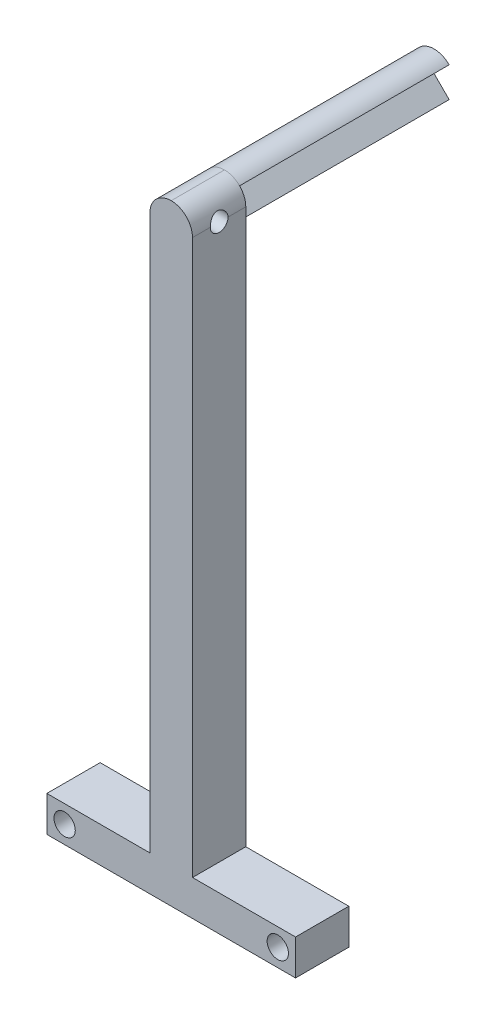
ISO-10303-21;
HEADER;
FILE_DESCRIPTION(('STEP AP214'),'2;1');
FILE_NAME('part.step','',(''),(''),'','','');
FILE_SCHEMA(('AUTOMOTIVE_DESIGN { 1 0 10303 214 1 1 1 1 }'));
ENDSEC;
DATA;
#1=APPLICATION_CONTEXT('core data for automotive mechanical design processes');
#2=APPLICATION_PROTOCOL_DEFINITION('international standard','automotive_design',2000,#1);
#3=PRODUCT_CONTEXT('',#1,'mechanical');
#4=PRODUCT('Part','Part','',(#3));
#5=PRODUCT_RELATED_PRODUCT_CATEGORY('part','',(#4));
#6=PRODUCT_DEFINITION_FORMATION('','',#4);
#7=PRODUCT_DEFINITION_CONTEXT('part definition',#1,'design');
#8=PRODUCT_DEFINITION('design','',#6,#7);
#9=PRODUCT_DEFINITION_SHAPE('','',#8);
#10=(LENGTH_UNIT() NAMED_UNIT(*) SI_UNIT(.MILLI.,.METRE.));
#11=(NAMED_UNIT(*) PLANE_ANGLE_UNIT() SI_UNIT($,.RADIAN.));
#12=(NAMED_UNIT(*) SI_UNIT($,.STERADIAN.) SOLID_ANGLE_UNIT());
#13=UNCERTAINTY_MEASURE_WITH_UNIT(LENGTH_MEASURE(1.E-05),#10,'distance_accuracy_value','');
#14=(GEOMETRIC_REPRESENTATION_CONTEXT(3) GLOBAL_UNCERTAINTY_ASSIGNED_CONTEXT((#13)) GLOBAL_UNIT_ASSIGNED_CONTEXT((#10,
#11,#12)) REPRESENTATION_CONTEXT('',''));
#15=CARTESIAN_POINT('',(0.,0.,0.));
#16=DIRECTION('',(0.,0.,1.));
#17=DIRECTION('',(1.,0.,0.));
#18=AXIS2_PLACEMENT_3D('',#15,#16,#17);
#19=CARTESIAN_POINT('',(0.,0.,59.));
#20=DIRECTION('',(0.707106781186546,0.707106781186549,0.));
#21=DIRECTION('',(-0.707106781186549,0.707106781186546,0.));
#22=AXIS2_PLACEMENT_3D('',#19,#20,#21);
#23=PLANE('',#22);
#24=DIRECTION('',(0.707106781186549,-0.707106781186546,0.));
#25=VECTOR('',#24,1.);
#26=CARTESIAN_POINT('',(0.,0.,0.));
#27=LINE('',#26,#25);
#28=CARTESIAN_POINT('',(0.,0.,0.));
#29=VERTEX_POINT('',#28);
#30=CARTESIAN_POINT('',(4.24264068711929,-4.24264068711928,0.));
#31=VERTEX_POINT('',#30);
#32=EDGE_CURVE('E174',#29,#31,#27,.T.);
#33=ORIENTED_EDGE('',*,*,#32,.F.);
#34=DIRECTION('',(0.,0.,-1.));
#35=VECTOR('',#34,1.);
#36=CARTESIAN_POINT('',(0.,0.,59.));
#37=LINE('',#36,#35);
#38=CARTESIAN_POINT('',(0.,0.,59.));
#39=VERTEX_POINT('',#38);
#40=EDGE_CURVE('E160',#39,#29,#37,.T.);
#41=ORIENTED_EDGE('',*,*,#40,.F.);
#42=DIRECTION('',(0.707106781186549,-0.707106781186546,0.));
#43=VECTOR('',#42,1.);
#44=CARTESIAN_POINT('',(0.,0.,59.));
#45=LINE('',#44,#43);
#46=CARTESIAN_POINT('',(4.24264068711929,-4.24264068711928,59.));
#47=VERTEX_POINT('',#46);
#48=EDGE_CURVE('E171',#39,#47,#45,.T.);
#49=ORIENTED_EDGE('',*,*,#48,.T.);
#50=DIRECTION('',(0.,0.,-1.));
#51=VECTOR('',#50,1.);
#52=CARTESIAN_POINT('',(4.24264068711929,-4.24264068711928,59.));
#53=LINE('',#52,#51);
#54=EDGE_CURVE('E165',#47,#31,#53,.T.);
#55=ORIENTED_EDGE('',*,*,#54,.T.);
#56=EDGE_LOOP('',(#33,#41,#49,#55));
#57=FACE_BOUND('',#56,.T.);
#58=ADVANCED_FACE('F35',(#57),#23,.T.);
#59=CARTESIAN_POINT('',(0.,0.,59.));
#60=DIRECTION('',(-0.707106781186549,0.707106781186546,0.));
#61=DIRECTION('',(-0.707106781186546,-0.707106781186549,0.));
#62=AXIS2_PLACEMENT_3D('',#59,#60,#61);
#63=PLANE('',#62);
#64=DIRECTION('',(0.707106781186546,0.707106781186549,0.));
#65=VECTOR('',#64,1.);
#66=CARTESIAN_POINT('',(0.,0.,0.));
#67=LINE('',#66,#65);
#68=CARTESIAN_POINT('',(4.24264068711928,4.24264068711929,0.));
#69=VERTEX_POINT('',#68);
#70=EDGE_CURVE('E172',#29,#69,#67,.T.);
#71=ORIENTED_EDGE('',*,*,#70,.T.);
#72=DIRECTION('',(0.,0.,-1.));
#73=VECTOR('',#72,1.);
#74=CARTESIAN_POINT('',(4.24264068711928,4.24264068711929,59.));
#75=LINE('',#74,#73);
#76=CARTESIAN_POINT('',(4.24264068711928,4.24264068711929,59.));
#77=VERTEX_POINT('',#76);
#78=EDGE_CURVE('E162',#77,#69,#75,.T.);
#79=ORIENTED_EDGE('',*,*,#78,.F.);
#80=DIRECTION('',(0.707106781186546,0.707106781186549,0.));
#81=VECTOR('',#80,1.);
#82=CARTESIAN_POINT('',(0.,0.,59.));
#83=LINE('',#82,#81);
#84=EDGE_CURVE('E181',#39,#77,#83,.T.);
#85=ORIENTED_EDGE('',*,*,#84,.F.);
#86=ORIENTED_EDGE('',*,*,#40,.T.);
#87=EDGE_LOOP('',(#71,#79,#85,#86));
#88=FACE_BOUND('',#87,.T.);
#89=ADVANCED_FACE('F316',(#88),#63,.F.);
#90=CARTESIAN_POINT('',(0.,0.,59.));
#91=DIRECTION('',(0.,0.,-1.));
#92=DIRECTION('',(-1.,0.,0.));
#93=AXIS2_PLACEMENT_3D('',#90,#91,#92);
#94=CYLINDRICAL_SURFACE('',#93,6.);
#95=CARTESIAN_POINT('',(0.,0.,0.));
#96=DIRECTION('',(0.,0.,1.));
#97=DIRECTION('',(1.,0.,0.));
#98=AXIS2_PLACEMENT_3D('',#95,#96,#97);
#99=CIRCLE('',#98,6.);
#100=EDGE_CURVE('E168',#69,#31,#99,.T.);
#101=ORIENTED_EDGE('',*,*,#100,.T.);
#102=ORIENTED_EDGE('',*,*,#54,.F.);
#103=CARTESIAN_POINT('',(0.,0.,59.));
#104=DIRECTION('',(0.,0.,1.));
#105=DIRECTION('',(1.,0.,0.));
#106=AXIS2_PLACEMENT_3D('',#103,#104,#105);
#107=CIRCLE('',#106,6.);
#108=CARTESIAN_POINT('',(-6.,0.,59.));
#109=VERTEX_POINT('',#108);
#110=EDGE_CURVE('E180',#109,#47,#107,.T.);
#111=ORIENTED_EDGE('',*,*,#110,.F.);
#112=CARTESIAN_POINT('',(0.,6.,59.));
#113=VERTEX_POINT('',#112);
#114=EDGE_CURVE('E148',#113,#109,#107,.T.);
#115=ORIENTED_EDGE('',*,*,#114,.F.);
#116=EDGE_CURVE('E167',#77,#113,#107,.T.);
#117=ORIENTED_EDGE('',*,*,#116,.F.);
#118=ORIENTED_EDGE('',*,*,#78,.T.);
#119=EDGE_LOOP('',(#101,#102,#111,#115,#117,#118));
#120=FACE_BOUND('',#119,.T.);
#121=ADVANCED_FACE('F277',(#120),#94,.T.);
#122=CARTESIAN_POINT('',(0.,0.,0.));
#123=DIRECTION('',(0.,0.,1.));
#124=DIRECTION('',(1.,0.,0.));
#125=AXIS2_PLACEMENT_3D('',#122,#123,#124);
#126=PLANE('',#125);
#127=ORIENTED_EDGE('',*,*,#32,.T.);
#128=ORIENTED_EDGE('',*,*,#100,.F.);
#129=ORIENTED_EDGE('',*,*,#70,.F.);
#130=EDGE_LOOP('',(#127,#128,#129));
#131=FACE_BOUND('',#130,.T.);
#132=ADVANCED_FACE('F328',(#131),#126,.F.);
#133=CARTESIAN_POINT('',(0.,0.,59.));
#134=DIRECTION('',(0.,0.,1.));
#135=DIRECTION('',(1.,0.,0.));
#136=AXIS2_PLACEMENT_3D('',#133,#134,#135);
#137=PLANE('',#136);
#138=CARTESIAN_POINT('',(30.,-161.,59.));
#139=DIRECTION('',(0.,0.,1.));
#140=DIRECTION('',(1.,0.,0.));
#141=AXIS2_PLACEMENT_3D('',#138,#139,#140);
#142=CIRCLE('',#141,3.);
#143=CARTESIAN_POINT('',(33.,-161.,59.));
#144=VERTEX_POINT('',#143);
#145=EDGE_CURVE('E144',#144,#144,#142,.T.);
#146=ORIENTED_EDGE('',*,*,#145,.T.);
#147=EDGE_LOOP('',(#146));
#148=FACE_BOUND('',#147,.T.);
#149=CARTESIAN_POINT('',(-30.,-161.,59.));
#150=DIRECTION('',(0.,0.,1.));
#151=DIRECTION('',(1.,0.,0.));
#152=AXIS2_PLACEMENT_3D('',#149,#150,#151);
#153=CIRCLE('',#152,3.);
#154=CARTESIAN_POINT('',(-27.,-161.,59.));
#155=VERTEX_POINT('',#154);
#156=EDGE_CURVE('E225',#155,#155,#153,.F.);
#157=ORIENTED_EDGE('',*,*,#156,.F.);
#158=EDGE_LOOP('',(#157));
#159=FACE_BOUND('',#158,.T.);
#160=DIRECTION('',(0.,-1.,0.));
#161=VECTOR('',#160,1.);
#162=CARTESIAN_POINT('',(-6.,0.,59.));
#163=LINE('',#162,#161);
#164=CARTESIAN_POINT('',(-5.99999999999998,-156.,59.));
#165=VERTEX_POINT('',#164);
#166=EDGE_CURVE('E186',#109,#165,#163,.T.);
#167=ORIENTED_EDGE('',*,*,#166,.F.);
#168=ORIENTED_EDGE('',*,*,#110,.T.);
#169=ORIENTED_EDGE('',*,*,#48,.F.);
#170=ORIENTED_EDGE('',*,*,#84,.T.);
#171=CARTESIAN_POINT('',(0.,0.,59.));
#172=DIRECTION('',(0.,0.,1.));
#173=DIRECTION('',(1.,0.,0.));
#174=AXIS2_PLACEMENT_3D('',#171,#172,#173);
#175=CIRCLE('',#174,6.);
#176=CARTESIAN_POINT('',(6.,0.,59.));
#177=VERTEX_POINT('',#176);
#178=EDGE_CURVE('E158',#77,#177,#175,.F.);
#179=ORIENTED_EDGE('',*,*,#178,.T.);
#180=DIRECTION('',(0.,-1.,0.));
#181=VECTOR('',#180,1.);
#182=CARTESIAN_POINT('',(6.,0.,59.));
#183=LINE('',#182,#181);
#184=CARTESIAN_POINT('',(6.00000000000002,-156.,59.));
#185=VERTEX_POINT('',#184);
#186=EDGE_CURVE('E189',#177,#185,#183,.T.);
#187=ORIENTED_EDGE('',*,*,#186,.T.);
#188=DIRECTION('',(-1.,0.,0.));
#189=VECTOR('',#188,1.);
#190=CARTESIAN_POINT('',(35.,-156.,59.));
#191=LINE('',#190,#189);
#192=CARTESIAN_POINT('',(35.,-156.,59.));
#193=VERTEX_POINT('',#192);
#194=EDGE_CURVE('E199',#193,#185,#191,.T.);
#195=ORIENTED_EDGE('',*,*,#194,.F.);
#196=DIRECTION('',(0.,-1.,0.));
#197=VECTOR('',#196,1.);
#198=CARTESIAN_POINT('',(35.,0.,59.));
#199=LINE('',#198,#197);
#200=CARTESIAN_POINT('',(35.,-166.,59.));
#201=VERTEX_POINT('',#200);
#202=EDGE_CURVE('E216',#193,#201,#199,.T.);
#203=ORIENTED_EDGE('',*,*,#202,.T.);
#204=DIRECTION('',(-1.,0.,0.));
#205=VECTOR('',#204,1.);
#206=CARTESIAN_POINT('',(35.,-166.,59.));
#207=LINE('',#206,#205);
#208=CARTESIAN_POINT('',(-35.,-166.,59.));
#209=VERTEX_POINT('',#208);
#210=EDGE_CURVE('E210',#201,#209,#207,.T.);
#211=ORIENTED_EDGE('',*,*,#210,.T.);
#212=DIRECTION('',(0.,-1.,0.));
#213=VECTOR('',#212,1.);
#214=CARTESIAN_POINT('',(-35.,0.,59.));
#215=LINE('',#214,#213);
#216=CARTESIAN_POINT('',(-35.,-156.,59.));
#217=VERTEX_POINT('',#216);
#218=EDGE_CURVE('E222',#217,#209,#215,.T.);
#219=ORIENTED_EDGE('',*,*,#218,.F.);
#220=EDGE_CURVE('E202',#165,#217,#191,.T.);
#221=ORIENTED_EDGE('',*,*,#220,.F.);
#222=EDGE_LOOP('',(#167,#168,#169,#170,#179,#187,#195,#203,#211,#219,#221));
#223=FACE_BOUND('',#222,.T.);
#224=ADVANCED_FACE('F270',(#148,#159,#223),#137,.F.);
#225=CARTESIAN_POINT('',(6.,0.,74.));
#226=DIRECTION('',(1.,0.,0.));
#227=DIRECTION('',(0.,1.,0.));
#228=AXIS2_PLACEMENT_3D('',#225,#226,#227);
#229=PLANE('',#228);
#230=CARTESIAN_POINT('',(6.,0.,66.5));
#231=DIRECTION('',(1.,0.,0.));
#232=DIRECTION('',(0.,1.,0.));
#233=AXIS2_PLACEMENT_3D('',#230,#231,#232);
#234=CIRCLE('',#233,2.5);
#235=CARTESIAN_POINT('',(6.,0.,69.));
#236=VERTEX_POINT('',#235);
#237=CARTESIAN_POINT('',(6.,0.,64.));
#238=VERTEX_POINT('',#237);
#239=EDGE_CURVE('E57',#236,#238,#234,.T.);
#240=ORIENTED_EDGE('',*,*,#239,.F.);
#241=DIRECTION('',(0.,0.,-1.));
#242=VECTOR('',#241,1.);
#243=CARTESIAN_POINT('',(6.,0.,74.));
#244=LINE('',#243,#242);
#245=CARTESIAN_POINT('',(6.,0.,74.));
#246=VERTEX_POINT('',#245);
#247=EDGE_CURVE('E157',#236,#246,#244,.F.);
#248=ORIENTED_EDGE('',*,*,#247,.T.);
#249=DIRECTION('',(0.,-1.,0.));
#250=VECTOR('',#249,1.);
#251=CARTESIAN_POINT('',(6.,0.,74.));
#252=LINE('',#251,#250);
#253=CARTESIAN_POINT('',(6.00000000000002,-156.,74.));
#254=VERTEX_POINT('',#253);
#255=EDGE_CURVE('E188',#246,#254,#252,.T.);
#256=ORIENTED_EDGE('',*,*,#255,.T.);
#257=DIRECTION('',(0.,0.,1.));
#258=VECTOR('',#257,1.);
#259=CARTESIAN_POINT('',(6.00000000000002,-156.,59.));
#260=LINE('',#259,#258);
#261=EDGE_CURVE('E196',#185,#254,#260,.T.);
#262=ORIENTED_EDGE('',*,*,#261,.F.);
#263=ORIENTED_EDGE('',*,*,#186,.F.);
#264=EDGE_CURVE('E154',#177,#238,#244,.F.);
#265=ORIENTED_EDGE('',*,*,#264,.T.);
#266=EDGE_LOOP('',(#240,#248,#256,#262,#263,#265));
#267=FACE_BOUND('',#266,.T.);
#268=ADVANCED_FACE('F266',(#267),#229,.T.);
#269=CARTESIAN_POINT('',(-6.,0.,74.));
#270=DIRECTION('',(1.,0.,0.));
#271=DIRECTION('',(0.,0.,-1.));
#272=AXIS2_PLACEMENT_3D('',#269,#270,#271);
#273=PLANE('',#272);
#274=DIRECTION('',(0.,0.,-1.));
#275=VECTOR('',#274,1.);
#276=CARTESIAN_POINT('',(-6.,0.,74.));
#277=LINE('',#276,#275);
#278=CARTESIAN_POINT('',(-6.,0.,74.));
#279=VERTEX_POINT('',#278);
#280=CARTESIAN_POINT('',(-6.,0.,69.));
#281=VERTEX_POINT('',#280);
#282=EDGE_CURVE('E11',#279,#281,#277,.T.);
#283=ORIENTED_EDGE('',*,*,#282,.T.);
#284=CARTESIAN_POINT('',(-6.,0.,66.5));
#285=DIRECTION('',(1.,0.,0.));
#286=DIRECTION('',(0.,0.,-1.));
#287=AXIS2_PLACEMENT_3D('',#284,#285,#286);
#288=CIRCLE('',#287,2.5);
#289=CARTESIAN_POINT('',(-6.,0.,64.));
#290=VERTEX_POINT('',#289);
#291=EDGE_CURVE('E50',#290,#281,#288,.F.);
#292=ORIENTED_EDGE('',*,*,#291,.F.);
#293=EDGE_CURVE('E44',#290,#109,#277,.T.);
#294=ORIENTED_EDGE('',*,*,#293,.T.);
#295=ORIENTED_EDGE('',*,*,#166,.T.);
#296=DIRECTION('',(0.,0.,-1.));
#297=VECTOR('',#296,1.);
#298=CARTESIAN_POINT('',(-5.99999999999998,-156.,74.));
#299=LINE('',#298,#297);
#300=CARTESIAN_POINT('',(-5.99999999999998,-156.,74.));
#301=VERTEX_POINT('',#300);
#302=EDGE_CURVE('E193',#301,#165,#299,.T.);
#303=ORIENTED_EDGE('',*,*,#302,.F.);
#304=DIRECTION('',(0.,-1.,0.));
#305=VECTOR('',#304,1.);
#306=CARTESIAN_POINT('',(-6.,0.,74.));
#307=LINE('',#306,#305);
#308=EDGE_CURVE('E177',#279,#301,#307,.T.);
#309=ORIENTED_EDGE('',*,*,#308,.F.);
#310=EDGE_LOOP('',(#283,#292,#294,#295,#303,#309));
#311=FACE_BOUND('',#310,.T.);
#312=ADVANCED_FACE('F141',(#311),#273,.F.);
#313=CARTESIAN_POINT('',(0.,0.,74.));
#314=DIRECTION('',(0.,0.,1.));
#315=DIRECTION('',(1.,0.,0.));
#316=AXIS2_PLACEMENT_3D('',#313,#314,#315);
#317=PLANE('',#316);
#318=CARTESIAN_POINT('',(30.,-161.,74.));
#319=DIRECTION('',(0.,0.,1.));
#320=DIRECTION('',(1.,0.,0.));
#321=AXIS2_PLACEMENT_3D('',#318,#319,#320);
#322=CIRCLE('',#321,3.);
#323=CARTESIAN_POINT('',(33.,-161.,74.));
#324=VERTEX_POINT('',#323);
#325=EDGE_CURVE('E238',#324,#324,#322,.F.);
#326=ORIENTED_EDGE('',*,*,#325,.T.);
#327=EDGE_LOOP('',(#326));
#328=FACE_BOUND('',#327,.T.);
#329=CARTESIAN_POINT('',(-30.,-161.,74.));
#330=DIRECTION('',(0.,0.,1.));
#331=DIRECTION('',(1.,0.,0.));
#332=AXIS2_PLACEMENT_3D('',#329,#330,#331);
#333=CIRCLE('',#332,3.);
#334=CARTESIAN_POINT('',(-27.,-161.,74.));
#335=VERTEX_POINT('',#334);
#336=EDGE_CURVE('E235',#335,#335,#333,.T.);
#337=ORIENTED_EDGE('',*,*,#336,.F.);
#338=EDGE_LOOP('',(#337));
#339=FACE_BOUND('',#338,.T.);
#340=ORIENTED_EDGE('',*,*,#255,.F.);
#341=CARTESIAN_POINT('',(0.,0.,74.));
#342=DIRECTION('',(0.,0.,1.));
#343=DIRECTION('',(1.,0.,0.));
#344=AXIS2_PLACEMENT_3D('',#341,#342,#343);
#345=CIRCLE('',#344,6.);
#346=CARTESIAN_POINT('',(0.,6.,74.));
#347=VERTEX_POINT('',#346);
#348=EDGE_CURVE('E149',#246,#347,#345,.T.);
#349=ORIENTED_EDGE('',*,*,#348,.T.);
#350=CARTESIAN_POINT('',(0.,0.,74.));
#351=DIRECTION('',(0.,0.,1.));
#352=DIRECTION('',(1.,0.,0.));
#353=AXIS2_PLACEMENT_3D('',#350,#351,#352);
#354=CIRCLE('',#353,6.);
#355=EDGE_CURVE('E150',#347,#279,#354,.T.);
#356=ORIENTED_EDGE('',*,*,#355,.T.);
#357=ORIENTED_EDGE('',*,*,#308,.T.);
#358=DIRECTION('',(-1.,0.,0.));
#359=VECTOR('',#358,1.);
#360=CARTESIAN_POINT('',(35.,-156.,74.));
#361=LINE('',#360,#359);
#362=CARTESIAN_POINT('',(-35.,-156.,74.));
#363=VERTEX_POINT('',#362);
#364=EDGE_CURVE('E206',#301,#363,#361,.T.);
#365=ORIENTED_EDGE('',*,*,#364,.T.);
#366=DIRECTION('',(0.,-1.,0.));
#367=VECTOR('',#366,1.);
#368=CARTESIAN_POINT('',(-35.,0.,74.));
#369=LINE('',#368,#367);
#370=CARTESIAN_POINT('',(-35.,-166.,74.));
#371=VERTEX_POINT('',#370);
#372=EDGE_CURVE('E217',#363,#371,#369,.T.);
#373=ORIENTED_EDGE('',*,*,#372,.T.);
#374=DIRECTION('',(-1.,0.,0.));
#375=VECTOR('',#374,1.);
#376=CARTESIAN_POINT('',(35.,-166.,74.));
#377=LINE('',#376,#375);
#378=CARTESIAN_POINT('',(35.,-166.,74.));
#379=VERTEX_POINT('',#378);
#380=EDGE_CURVE('E207',#379,#371,#377,.T.);
#381=ORIENTED_EDGE('',*,*,#380,.F.);
#382=DIRECTION('',(0.,-1.,0.));
#383=VECTOR('',#382,1.);
#384=CARTESIAN_POINT('',(35.,0.,74.));
#385=LINE('',#384,#383);
#386=CARTESIAN_POINT('',(35.,-156.,74.));
#387=VERTEX_POINT('',#386);
#388=EDGE_CURVE('E227',#387,#379,#385,.T.);
#389=ORIENTED_EDGE('',*,*,#388,.F.);
#390=EDGE_CURVE('E203',#387,#254,#361,.T.);
#391=ORIENTED_EDGE('',*,*,#390,.T.);
#392=EDGE_LOOP('',(#340,#349,#356,#357,#365,#373,#381,#389,#391));
#393=FACE_BOUND('',#392,.T.);
#394=ADVANCED_FACE('F283',(#328,#339,#393),#317,.T.);
#395=CARTESIAN_POINT('',(0.,0.,74.));
#396=DIRECTION('',(0.,0.,-1.));
#397=DIRECTION('',(-1.,0.,0.));
#398=AXIS2_PLACEMENT_3D('',#395,#396,#397);
#399=CYLINDRICAL_SURFACE('',#398,6.);
#400=CARTESIAN_POINT('',(-6.,0.,64.));
#401=CARTESIAN_POINT('',(-6.00001037607266,0.0672467819789684,63.9999903418838));
#402=CARTESIAN_POINT('',(-5.99886972729209,0.1344870780279,64.0027130418925));
#403=CARTESIAN_POINT('',(-5.99436389136702,0.268436474652213,64.0135481388044));
#404=CARTESIAN_POINT('',(-5.9909994017134,0.335145735145769,64.0216588458039));
#405=CARTESIAN_POINT('',(-5.9821393320281,0.467318540849067,64.0431561380973));
#406=CARTESIAN_POINT('',(-5.9766514916488,0.532785714640105,64.0565235654111));
#407=CARTESIAN_POINT('',(-5.96369625967271,0.662243815692014,64.0883858667239));
#408=CARTESIAN_POINT('',(-5.95622878156179,0.72623467830226,64.1068809648141));
#409=CARTESIAN_POINT('',(-5.93113961074656,0.915238447043913,64.1697810884129));
#410=CARTESIAN_POINT('',(-5.91081524140385,1.03750625007479,64.2216378742179));
#411=CARTESIAN_POINT('',(-5.86493193934277,1.27155815516613,64.3434752451685));
#412=CARTESIAN_POINT('',(-5.8393689788338,1.38333409335877,64.4134697868916));
#413=CARTESIAN_POINT('',(-5.7841553655003,1.59889753990474,64.5732611077741));
#414=CARTESIAN_POINT('',(-5.75437187065275,1.70209249703602,64.6638122591677));
#415=CARTESIAN_POINT('',(-5.69465088134192,1.89233069289957,64.8605407587192));
#416=CARTESIAN_POINT('',(-5.66471332814875,1.97936721723814,64.9667245700794));
#417=CARTESIAN_POINT('',(-5.60642016167437,2.13907516647494,65.1980546503272));
#418=CARTESIAN_POINT('',(-5.57821516912517,2.21082751785293,65.3238774425977));
#419=CARTESIAN_POINT('',(-5.52871100201466,2.33187993592177,65.5871493606241));
#420=CARTESIAN_POINT('',(-5.50740813132743,2.38119202524442,65.72459221388));
#421=CARTESIAN_POINT('',(-5.47557127371673,2.45349156514128,66.0003059519483));
#422=CARTESIAN_POINT('',(-5.46456798419849,2.47763264131377,66.1382180422796));
#423=CARTESIAN_POINT('',(-5.45322653381249,2.50250418824811,66.4165436127079));
#424=CARTESIAN_POINT('',(-5.45288271583108,2.50324707672149,66.5569557264185));
#425=CARTESIAN_POINT('',(-5.462502432477,2.48216891666661,66.8248012761567));
#426=CARTESIAN_POINT('',(-5.47167782028316,2.46207326626338,66.952404485184));
#427=CARTESIAN_POINT('',(-5.49796996212339,2.40278311071196,67.2022263795275));
#428=CARTESIAN_POINT('',(-5.51508809479591,2.36358528990162,67.3244441260438));
#429=CARTESIAN_POINT('',(-5.55572355927957,2.26643952439765,67.5631146045459));
#430=CARTESIAN_POINT('',(-5.57936932415309,2.20811029766716,67.679389293079));
#431=CARTESIAN_POINT('',(-5.63036626280142,2.07462575120747,67.9009540846201));
#432=CARTESIAN_POINT('',(-5.65771894481633,1.99946357446041,68.006239685451));
#433=CARTESIAN_POINT('',(-5.71585796146129,1.82699696868281,68.2121943190329));
#434=CARTESIAN_POINT('',(-5.74673919648569,1.72835868701981,68.3117226510067));
#435=CARTESIAN_POINT('',(-5.8065104722559,1.51546962289756,68.4932185963493));
#436=CARTESIAN_POINT('',(-5.83539983701505,1.40121357904726,68.5751802677747));
#437=CARTESIAN_POINT('',(-5.88877935218559,1.15683847588285,68.7209087158971));
#438=CARTESIAN_POINT('',(-5.91314988053893,1.02640921206957,68.7842015526249));
#439=CARTESIAN_POINT('',(-5.95380670055751,0.755539657911763,68.8874853412247));
#440=CARTESIAN_POINT('',(-5.9701056373927,0.615115423277552,68.9275127585209));
#441=CARTESIAN_POINT('',(-5.98753230378427,0.394409545226777,68.9699622833936));
#442=CARTESIAN_POINT('',(-5.99218938828637,0.31600353155667,68.9812108200079));
#443=CARTESIAN_POINT('',(-5.99842891325179,0.15841475426538,68.9962310217523));
#444=CARTESIAN_POINT('',(-6.00001352554418,0.0792325791085544,69.0000079683407));
#445=CARTESIAN_POINT('',(-6.,0.,69.));
#446=B_SPLINE_CURVE_WITH_KNOTS('',3,(#400,#401,#402,#403,#404,#405,#406,#407,#408,#409,#410,
#411,#412,#413,#414,#415,#416,#417,#418,#419,#420,#421,#422,#423,#424,#425,#426,#427,#428,#429,
#430,#431,#432,#433,#434,#435,#436,#437,#438,#439,#440,#441,#442,#443,#444,#445),.UNSPECIFIED.,
.F.,.F.,(4,2,2,2,2,2,2,2,2,2,2,2,2,2,2,2,2,2,2,2,2,2,4),(0.,0.201664688779432,0.403266156948419,
0.604139603457146,0.805021829982837,1.20611296768778,1.60751365684137,2.02712661354182,
2.44691354572159,2.88738376512078,3.32761771882918,3.74664582741082,4.16545154877286,
4.55215139056243,4.93891837775621,5.33391643843287,5.72907569790697,6.15760537163508,
6.58627976805843,7.02504933088064,7.46312931376069,7.70079286275018,7.93828835389689),.UNSPECIFIED.);
#447=EDGE_CURVE('E134',#290,#281,#446,.T.);
#448=ORIENTED_EDGE('',*,*,#447,.T.);
#449=ORIENTED_EDGE('',*,*,#282,.F.);
#450=ORIENTED_EDGE('',*,*,#355,.F.);
#451=DIRECTION('',(0.,0.,-1.));
#452=VECTOR('',#451,1.);
#453=CARTESIAN_POINT('',(0.,6.,74.));
#454=LINE('',#453,#452);
#455=EDGE_CURVE('E39',#113,#347,#454,.F.);
#456=ORIENTED_EDGE('',*,*,#455,.F.);
#457=ORIENTED_EDGE('',*,*,#114,.T.);
#458=ORIENTED_EDGE('',*,*,#293,.F.);
#459=EDGE_LOOP('',(#448,#449,#450,#456,#457,#458));
#460=FACE_BOUND('',#459,.T.);
#461=ADVANCED_FACE('F37',(#460),#399,.T.);
#462=CARTESIAN_POINT('',(0.,0.,74.));
#463=DIRECTION('',(0.,0.,1.));
#464=DIRECTION('',(1.,0.,0.));
#465=AXIS2_PLACEMENT_3D('',#462,#463,#464);
#466=CYLINDRICAL_SURFACE('',#465,6.);
#467=CARTESIAN_POINT('',(6.,0.,69.));
#468=CARTESIAN_POINT('',(6.00001037607266,0.0672467819789692,69.0000096581162));
#469=CARTESIAN_POINT('',(5.99886972729209,0.134487078027901,68.9972869581075));
#470=CARTESIAN_POINT('',(5.99436389136702,0.268436474652214,68.9864518611956));
#471=CARTESIAN_POINT('',(5.99099940171341,0.33514573514577,68.9783411541961));
#472=CARTESIAN_POINT('',(5.9821393320281,0.467318540849068,68.9568438619027));
#473=CARTESIAN_POINT('',(5.9766514916488,0.532785714640106,68.9434764345889));
#474=CARTESIAN_POINT('',(5.96369625967271,0.662243815692015,68.9116141332761));
#475=CARTESIAN_POINT('',(5.95622878156179,0.726234678302261,68.8931190351859));
#476=CARTESIAN_POINT('',(5.93113961074656,0.915238447043914,68.8302189115871));
#477=CARTESIAN_POINT('',(5.91081524140385,1.03750625007479,68.7783621257821));
#478=CARTESIAN_POINT('',(5.86493193934277,1.27155815516613,68.6565247548315));
#479=CARTESIAN_POINT('',(5.8393689788338,1.38333409335877,68.5865302131084));
#480=CARTESIAN_POINT('',(5.7841553655003,1.59889753990474,68.4267388922259));
#481=CARTESIAN_POINT('',(5.75437187065275,1.70209249703603,68.3361877408323));
#482=CARTESIAN_POINT('',(5.69465088134192,1.89233069289958,68.1394592412808));
#483=CARTESIAN_POINT('',(5.66471332814875,1.97936721723814,68.0332754299206));
#484=CARTESIAN_POINT('',(5.60642016167438,2.13907516647494,67.8019453496728));
#485=CARTESIAN_POINT('',(5.57821516912518,2.21082751785293,67.6761225574023));
#486=CARTESIAN_POINT('',(5.52871100201466,2.33187993592177,67.4128506393759));
#487=CARTESIAN_POINT('',(5.50740813132743,2.38119202524443,67.27540778612));
#488=CARTESIAN_POINT('',(5.47557127371673,2.45349156514128,66.9996940480517));
#489=CARTESIAN_POINT('',(5.46456798419849,2.47763264131378,66.8617819577204));
#490=CARTESIAN_POINT('',(5.45322653381249,2.50250418824811,66.5834563872921));
#491=CARTESIAN_POINT('',(5.45288271583108,2.50324707672149,66.4430442735815));
#492=CARTESIAN_POINT('',(5.462502432477,2.48216891666661,66.1751987238433));
#493=CARTESIAN_POINT('',(5.47167782028316,2.46207326626339,66.047595514816));
#494=CARTESIAN_POINT('',(5.49796996212339,2.40278311071196,65.7977736204725));
#495=CARTESIAN_POINT('',(5.51508809479591,2.36358528990162,65.6755558739562));
#496=CARTESIAN_POINT('',(5.55572355927957,2.26643952439765,65.4368853954541));
#497=CARTESIAN_POINT('',(5.57936932415309,2.20811029766716,65.320610706921));
#498=CARTESIAN_POINT('',(5.63036626280142,2.07462575120747,65.0990459153799));
#499=CARTESIAN_POINT('',(5.65771894481633,1.99946357446041,64.993760314549));
#500=CARTESIAN_POINT('',(5.71585796146129,1.82699696868281,64.7878056809671));
#501=CARTESIAN_POINT('',(5.74673919648569,1.7283586870198,64.6882773489933));
#502=CARTESIAN_POINT('',(5.8065104722559,1.51546962289755,64.5067814036507));
#503=CARTESIAN_POINT('',(5.83539983701505,1.40121357904726,64.4248197322253));
#504=CARTESIAN_POINT('',(5.88877935218559,1.15683847588285,64.2790912841029));
#505=CARTESIAN_POINT('',(5.91314988053893,1.02640921206957,64.2157984473751));
#506=CARTESIAN_POINT('',(5.95380670055751,0.755539657911765,64.1125146587753));
#507=CARTESIAN_POINT('',(5.9701056373927,0.615115423277554,64.0724872414791));
#508=CARTESIAN_POINT('',(5.98753230378427,0.394409545226779,64.0300377166065));
#509=CARTESIAN_POINT('',(5.99218938828637,0.316003531556673,64.0187891799921));
#510=CARTESIAN_POINT('',(5.99842891325179,0.158414754265383,64.0037689782477));
#511=CARTESIAN_POINT('',(6.00001352554418,0.0792325791085561,63.9999920316593));
#512=CARTESIAN_POINT('',(6.,0.,64.));
#513=B_SPLINE_CURVE_WITH_KNOTS('',3,(#467,#468,#469,#470,#471,#472,#473,#474,#475,#476,#477,
#478,#479,#480,#481,#482,#483,#484,#485,#486,#487,#488,#489,#490,#491,#492,#493,#494,#495,#496,
#497,#498,#499,#500,#501,#502,#503,#504,#505,#506,#507,#508,#509,#510,#511,#512),.UNSPECIFIED.,
.F.,.F.,(4,2,2,2,2,2,2,2,2,2,2,2,2,2,2,2,2,2,2,2,2,2,4),(0.,0.201664688779432,0.403266156948419,
0.604139603457146,0.805021829982837,1.20611296768778,1.60751365684137,2.02712661354182,
2.44691354572159,2.88738376512078,3.32761771882918,3.74664582741082,4.16545154877286,
4.55215139056243,4.93891837775621,5.33391643843287,5.72907569790697,6.1576053716351,
6.58627976805844,7.02504933088064,7.4631293137607,7.70079286275018,7.93828835389689),.UNSPECIFIED.);
#514=EDGE_CURVE('E254',#236,#238,#513,.T.);
#515=ORIENTED_EDGE('',*,*,#514,.T.);
#516=ORIENTED_EDGE('',*,*,#264,.F.);
#517=ORIENTED_EDGE('',*,*,#178,.F.);
#518=ORIENTED_EDGE('',*,*,#116,.T.);
#519=ORIENTED_EDGE('',*,*,#455,.T.);
#520=ORIENTED_EDGE('',*,*,#348,.F.);
#521=ORIENTED_EDGE('',*,*,#247,.F.);
#522=EDGE_LOOP('',(#515,#516,#517,#518,#519,#520,#521));
#523=FACE_BOUND('',#522,.T.);
#524=ADVANCED_FACE('F261',(#523),#466,.T.);
#525=CARTESIAN_POINT('',(35.,-156.,0.));
#526=DIRECTION('',(0.,-1.,0.));
#527=DIRECTION('',(0.,0.,-1.));
#528=AXIS2_PLACEMENT_3D('',#525,#526,#527);
#529=PLANE('',#528);
#530=ORIENTED_EDGE('',*,*,#194,.T.);
#531=ORIENTED_EDGE('',*,*,#261,.T.);
#532=ORIENTED_EDGE('',*,*,#390,.F.);
#533=DIRECTION('',(0.,0.,1.));
#534=VECTOR('',#533,1.);
#535=CARTESIAN_POINT('',(35.,-156.,0.));
#536=LINE('',#535,#534);
#537=EDGE_CURVE('E229',#193,#387,#536,.T.);
#538=ORIENTED_EDGE('',*,*,#537,.F.);
#539=EDGE_LOOP('',(#530,#531,#532,#538));
#540=FACE_BOUND('',#539,.T.);
#541=ADVANCED_FACE('F306',(#540),#529,.F.);
#542=ORIENTED_EDGE('',*,*,#364,.F.);
#543=ORIENTED_EDGE('',*,*,#302,.T.);
#544=ORIENTED_EDGE('',*,*,#220,.T.);
#545=DIRECTION('',(0.,0.,1.));
#546=VECTOR('',#545,1.);
#547=CARTESIAN_POINT('',(-35.,-156.,0.));
#548=LINE('',#547,#546);
#549=EDGE_CURVE('E219',#217,#363,#548,.T.);
#550=ORIENTED_EDGE('',*,*,#549,.T.);
#551=EDGE_LOOP('',(#542,#543,#544,#550));
#552=FACE_BOUND('',#551,.T.);
#553=ADVANCED_FACE('F288',(#552),#529,.F.);
#554=CARTESIAN_POINT('',(35.,-166.,0.));
#555=DIRECTION('',(0.,1.,0.));
#556=DIRECTION('',(0.,0.,1.));
#557=AXIS2_PLACEMENT_3D('',#554,#555,#556);
#558=PLANE('',#557);
#559=DIRECTION('',(0.,0.,-1.));
#560=VECTOR('',#559,1.);
#561=CARTESIAN_POINT('',(-35.,-166.,0.));
#562=LINE('',#561,#560);
#563=EDGE_CURVE('E213',#371,#209,#562,.T.);
#564=ORIENTED_EDGE('',*,*,#563,.T.);
#565=ORIENTED_EDGE('',*,*,#210,.F.);
#566=DIRECTION('',(0.,0.,-1.));
#567=VECTOR('',#566,1.);
#568=CARTESIAN_POINT('',(35.,-166.,0.));
#569=LINE('',#568,#567);
#570=EDGE_CURVE('E212',#379,#201,#569,.T.);
#571=ORIENTED_EDGE('',*,*,#570,.F.);
#572=ORIENTED_EDGE('',*,*,#380,.T.);
#573=EDGE_LOOP('',(#564,#565,#571,#572));
#574=FACE_BOUND('',#573,.T.);
#575=ADVANCED_FACE('F297',(#574),#558,.F.);
#576=CARTESIAN_POINT('',(35.,0.,0.));
#577=DIRECTION('',(1.,0.,0.));
#578=DIRECTION('',(0.,0.,-1.));
#579=AXIS2_PLACEMENT_3D('',#576,#577,#578);
#580=PLANE('',#579);
#581=ORIENTED_EDGE('',*,*,#202,.F.);
#582=ORIENTED_EDGE('',*,*,#537,.T.);
#583=ORIENTED_EDGE('',*,*,#388,.T.);
#584=ORIENTED_EDGE('',*,*,#570,.T.);
#585=EDGE_LOOP('',(#581,#582,#583,#584));
#586=FACE_BOUND('',#585,.T.);
#587=ADVANCED_FACE('F303',(#586),#580,.T.);
#588=CARTESIAN_POINT('',(-35.,0.,0.));
#589=DIRECTION('',(1.,0.,0.));
#590=DIRECTION('',(0.,0.,-1.));
#591=AXIS2_PLACEMENT_3D('',#588,#589,#590);
#592=PLANE('',#591);
#593=ORIENTED_EDGE('',*,*,#218,.T.);
#594=ORIENTED_EDGE('',*,*,#563,.F.);
#595=ORIENTED_EDGE('',*,*,#372,.F.);
#596=ORIENTED_EDGE('',*,*,#549,.F.);
#597=EDGE_LOOP('',(#593,#594,#595,#596));
#598=FACE_BOUND('',#597,.T.);
#599=ADVANCED_FACE('F299',(#598),#592,.F.);
#600=CARTESIAN_POINT('',(-30.,-161.,-0.001000000000001));
#601=DIRECTION('',(0.,0.,1.));
#602=DIRECTION('',(1.,0.,0.));
#603=AXIS2_PLACEMENT_3D('',#600,#601,#602);
#604=CYLINDRICAL_SURFACE('',#603,3.);
#605=ORIENTED_EDGE('',*,*,#336,.T.);
#606=EDGE_LOOP('',(#605));
#607=FACE_BOUND('',#606,.T.);
#608=ORIENTED_EDGE('',*,*,#156,.T.);
#609=EDGE_LOOP('',(#608));
#610=FACE_BOUND('',#609,.T.);
#611=ADVANCED_FACE('F347',(#607,#610),#604,.F.);
#612=CARTESIAN_POINT('',(30.,-161.,-0.001000000000001));
#613=DIRECTION('',(0.,0.,1.));
#614=DIRECTION('',(1.,0.,0.));
#615=AXIS2_PLACEMENT_3D('',#612,#613,#614);
#616=CYLINDRICAL_SURFACE('',#615,3.);
#617=ORIENTED_EDGE('',*,*,#325,.F.);
#618=EDGE_LOOP('',(#617));
#619=FACE_BOUND('',#618,.T.);
#620=ORIENTED_EDGE('',*,*,#145,.F.);
#621=EDGE_LOOP('',(#620));
#622=FACE_BOUND('',#621,.T.);
#623=ADVANCED_FACE('F350',(#619,#622),#616,.F.);
#624=CARTESIAN_POINT('',(-35.001,0.,66.5));
#625=DIRECTION('',(1.,0.,0.));
#626=DIRECTION('',(0.,1.,0.));
#627=AXIS2_PLACEMENT_3D('',#624,#625,#626);
#628=CYLINDRICAL_SURFACE('',#627,2.5);
#629=ORIENTED_EDGE('',*,*,#239,.T.);
#630=ORIENTED_EDGE('',*,*,#514,.F.);
#631=EDGE_LOOP('',(#629,#630));
#632=FACE_BOUND('',#631,.T.);
#633=ORIENTED_EDGE('',*,*,#291,.T.);
#634=ORIENTED_EDGE('',*,*,#447,.F.);
#635=EDGE_LOOP('',(#633,#634));
#636=FACE_BOUND('',#635,.T.);
#637=ADVANCED_FACE('F135',(#632,#636),#628,.F.);
#638=CLOSED_SHELL('',(#58,#89,#121,#132,#224,#268,#312,#394,#461,#524,#541,#553,#575,#587,#599,
#611,#623,#637));
#639=MANIFOLD_SOLID_BREP('B2',#638);
#640=ADVANCED_BREP_SHAPE_REPRESENTATION('',(#18,#639),#14);
#641=SHAPE_DEFINITION_REPRESENTATION(#9,#640);
ENDSEC;
END-ISO-10303-21;
